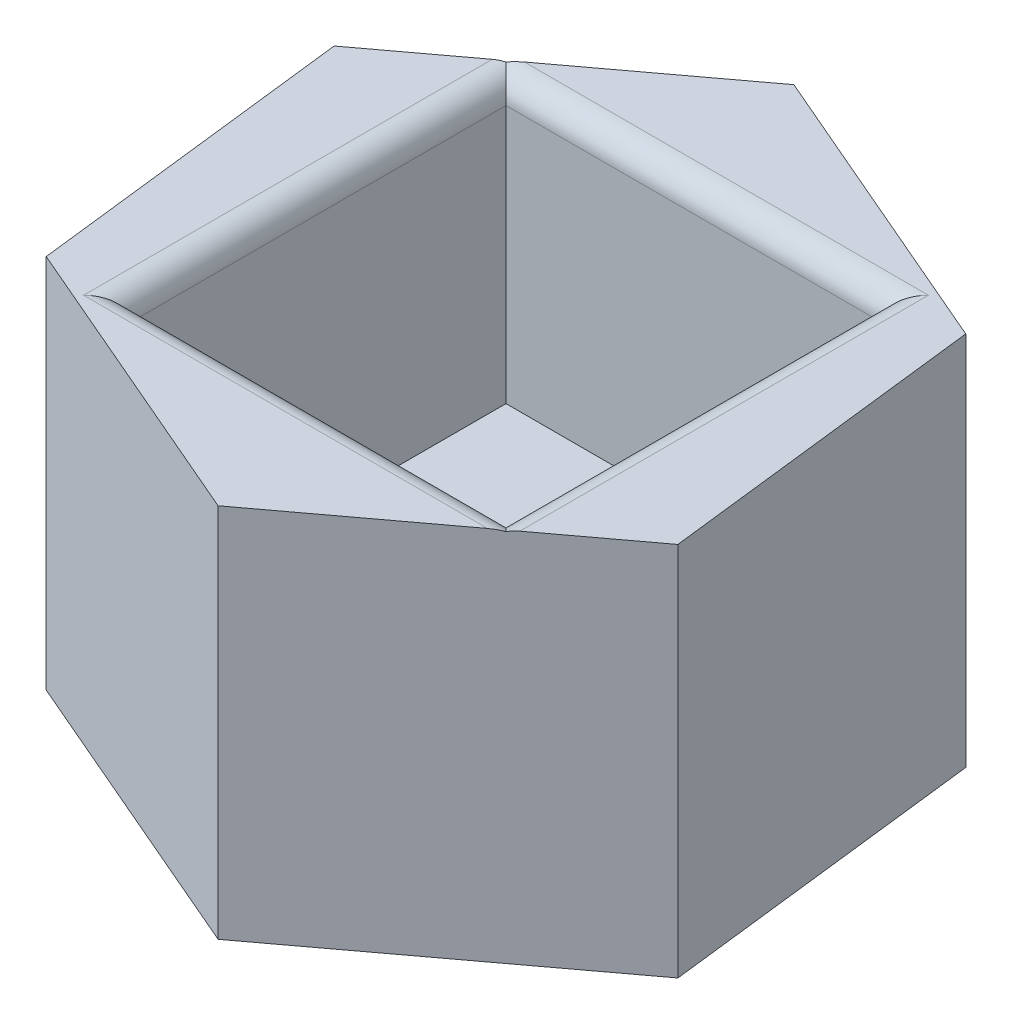
ISO-10303-21;
HEADER;
FILE_DESCRIPTION(('STEP AP214'),'2;1');
FILE_NAME('part.step','',(''),(''),'','','');
FILE_SCHEMA(('AUTOMOTIVE_DESIGN { 1 0 10303 214 1 1 1 1 }'));
ENDSEC;
DATA;
#1=APPLICATION_CONTEXT('core data for automotive mechanical design processes');
#2=APPLICATION_PROTOCOL_DEFINITION('international standard','automotive_design',2000,#1);
#3=PRODUCT_CONTEXT('',#1,'mechanical');
#4=PRODUCT('Part','Part','',(#3));
#5=PRODUCT_RELATED_PRODUCT_CATEGORY('part','',(#4));
#6=PRODUCT_DEFINITION_FORMATION('','',#4);
#7=PRODUCT_DEFINITION_CONTEXT('part definition',#1,'design');
#8=PRODUCT_DEFINITION('design','',#6,#7);
#9=PRODUCT_DEFINITION_SHAPE('','',#8);
#10=(LENGTH_UNIT() NAMED_UNIT(*) SI_UNIT(.MILLI.,.METRE.));
#11=(NAMED_UNIT(*) PLANE_ANGLE_UNIT() SI_UNIT($,.RADIAN.));
#12=(NAMED_UNIT(*) SI_UNIT($,.STERADIAN.) SOLID_ANGLE_UNIT());
#13=UNCERTAINTY_MEASURE_WITH_UNIT(LENGTH_MEASURE(1.E-05),#10,'distance_accuracy_value','');
#14=(GEOMETRIC_REPRESENTATION_CONTEXT(3) GLOBAL_UNCERTAINTY_ASSIGNED_CONTEXT((#13)) GLOBAL_UNIT_ASSIGNED_CONTEXT((#10,
#11,#12)) REPRESENTATION_CONTEXT('',''));
#15=CARTESIAN_POINT('',(0.,0.,0.));
#16=DIRECTION('',(0.,0.,1.));
#17=DIRECTION('',(1.,0.,0.));
#18=AXIS2_PLACEMENT_3D('',#15,#16,#17);
#19=CARTESIAN_POINT('',(0.,4.,0.));
#20=DIRECTION('',(0.,1.,0.));
#21=DIRECTION('',(0.,0.,1.));
#22=AXIS2_PLACEMENT_3D('',#19,#20,#21);
#23=PLANE('',#22);
#24=DIRECTION('',(1.,0.,0.));
#25=VECTOR('',#24,1.);
#26=CARTESIAN_POINT('',(0.,4.,-2.25));
#27=LINE('',#26,#25);
#28=CARTESIAN_POINT('',(-2.05318407785259,4.,-2.25));
#29=VERTEX_POINT('',#28);
#30=CARTESIAN_POINT('',(2.25,4.,-2.25));
#31=VERTEX_POINT('',#30);
#32=EDGE_CURVE('E289',#29,#31,#27,.T.);
#33=ORIENTED_EDGE('',*,*,#32,.T.);
#34=DIRECTION('',(0.,0.,-1.));
#35=VECTOR('',#34,1.);
#36=CARTESIAN_POINT('',(2.25,4.,2.));
#37=LINE('',#36,#35);
#38=CARTESIAN_POINT('',(2.25,4.,2.1032376772573));
#39=VERTEX_POINT('',#38);
#40=EDGE_CURVE('E292',#31,#39,#37,.F.);
#41=ORIENTED_EDGE('',*,*,#40,.T.);
#42=DIRECTION('',(0.801658028534698,0.,-0.597782908158021));
#43=VECTOR('',#42,1.);
#44=CARTESIAN_POINT('',(0.409031595509729,4.,3.47601685178233));
#45=LINE('',#44,#43);
#46=CARTESIAN_POINT('',(3.21483469538117,4.,1.38377667322926));
#47=VERTEX_POINT('',#46);
#48=EDGE_CURVE('E215',#39,#47,#45,.T.);
#49=ORIENTED_EDGE('',*,*,#48,.T.);
#50=DIRECTION('',(-0.116866170145637,0.,-0.99314767193781));
#51=VECTOR('',#50,1.);
#52=CARTESIAN_POINT('',(3.21483469538117,4.,1.38377667322926));
#53=LINE('',#52,#51);
#54=CARTESIAN_POINT('',(2.80580309987144,4.,-2.09224017855307));
#55=VERTEX_POINT('',#54);
#56=EDGE_CURVE('E214',#47,#55,#53,.T.);
#57=ORIENTED_EDGE('',*,*,#56,.T.);
#58=DIRECTION('',(-0.918524198680335,0.,-0.395364763779788));
#59=VECTOR('',#58,1.);
#60=CARTESIAN_POINT('',(2.80580309987144,4.,-2.09224017855307));
#61=LINE('',#60,#59);
#62=CARTESIAN_POINT('',(-0.409031595509729,4.,-3.47601685178233));
#63=VERTEX_POINT('',#62);
#64=EDGE_CURVE('E218',#55,#63,#61,.T.);
#65=ORIENTED_EDGE('',*,*,#64,.T.);
#66=DIRECTION('',(-0.801658028534698,0.,0.597782908158021));
#67=VECTOR('',#66,1.);
#68=CARTESIAN_POINT('',(-0.409031595509729,4.,-3.47601685178233));
#69=LINE('',#68,#67);
#70=EDGE_CURVE('E222',#63,#29,#69,.T.);
#71=ORIENTED_EDGE('',*,*,#70,.T.);
#72=EDGE_LOOP('',(#33,#41,#49,#57,#65,#71));
#73=FACE_BOUND('',#72,.T.);
#74=ADVANCED_FACE('F60',(#73),#23,.T.);
#75=CARTESIAN_POINT('',(0.409031595509729,4.,3.47601685178233));
#76=DIRECTION('',(-0.597782908158021,0.,-0.801658028534698));
#77=DIRECTION('',(-0.801658028534698,0.,0.597782908158021));
#78=AXIS2_PLACEMENT_3D('',#75,#76,#77);
#79=PLANE('',#78);
#80=CARTESIAN_POINT('',(2.25,3.75,2.1032376772573));
#81=DIRECTION('',(-0.597782908158021,0.,-0.801658028534698));
#82=DIRECTION('',(-0.801658028534698,0.,0.597782908158021));
#83=AXIS2_PLACEMENT_3D('',#80,#81,#82);
#84=ELLIPSE('',#83,0.311853672141174,0.25);
#85=CARTESIAN_POINT('',(2.1659284316842,3.98543995285619,2.1659284316842));
#86=VERTEX_POINT('',#85);
#87=EDGE_CURVE('E276',#39,#86,#84,.F.);
#88=ORIENTED_EDGE('',*,*,#87,.T.);
#89=CARTESIAN_POINT('',(2.05318407785259,3.75,2.25));
#90=DIRECTION('',(-0.597782908158021,0.,-0.801658028534698));
#91=DIRECTION('',(-0.801658028534698,0.,0.597782908158021));
#92=AXIS2_PLACEMENT_3D('',#89,#90,#91);
#93=ELLIPSE('',#92,0.418212024111458,0.25);
#94=CARTESIAN_POINT('',(2.05318407785259,4.,2.25));
#95=VERTEX_POINT('',#94);
#96=EDGE_CURVE('E279',#86,#95,#93,.F.);
#97=ORIENTED_EDGE('',*,*,#96,.T.);
#98=CARTESIAN_POINT('',(0.409031595509729,4.,3.47601685178233));
#99=VERTEX_POINT('',#98);
#100=EDGE_CURVE('E210',#99,#95,#45,.T.);
#101=ORIENTED_EDGE('',*,*,#100,.F.);
#102=DIRECTION('',(0.,-1.,0.));
#103=VECTOR('',#102,1.);
#104=CARTESIAN_POINT('',(0.409031595509729,4.,3.47601685178233));
#105=LINE('',#104,#103);
#106=CARTESIAN_POINT('',(0.409031595509729,0.,3.47601685178233));
#107=VERTEX_POINT('',#106);
#108=EDGE_CURVE('E232',#99,#107,#105,.T.);
#109=ORIENTED_EDGE('',*,*,#108,.T.);
#110=DIRECTION('',(0.801658028534698,0.,-0.597782908158021));
#111=VECTOR('',#110,1.);
#112=CARTESIAN_POINT('',(0.409031595509729,0.,3.47601685178233));
#113=LINE('',#112,#111);
#114=CARTESIAN_POINT('',(3.21483469538117,0.,1.38377667322926));
#115=VERTEX_POINT('',#114);
#116=EDGE_CURVE('E204',#107,#115,#113,.T.);
#117=ORIENTED_EDGE('',*,*,#116,.T.);
#118=DIRECTION('',(0.,-1.,0.));
#119=VECTOR('',#118,1.);
#120=CARTESIAN_POINT('',(3.21483469538117,4.,1.38377667322926));
#121=LINE('',#120,#119);
#122=EDGE_CURVE('E270',#47,#115,#121,.T.);
#123=ORIENTED_EDGE('',*,*,#122,.F.);
#124=ORIENTED_EDGE('',*,*,#48,.F.);
#125=EDGE_LOOP('',(#88,#97,#101,#109,#117,#123,#124));
#126=FACE_BOUND('',#125,.T.);
#127=ADVANCED_FACE('F338',(#126),#79,.F.);
#128=CARTESIAN_POINT('',(3.21483469538117,4.,1.38377667322926));
#129=DIRECTION('',(-0.99314767193781,0.,0.116866170145637));
#130=DIRECTION('',(0.116866170145637,0.,0.99314767193781));
#131=AXIS2_PLACEMENT_3D('',#128,#129,#130);
#132=PLANE('',#131);
#133=DIRECTION('',(-0.116866170145637,0.,-0.99314767193781));
#134=VECTOR('',#133,1.);
#135=CARTESIAN_POINT('',(3.21483469538117,0.,1.38377667322926));
#136=LINE('',#135,#134);
#137=CARTESIAN_POINT('',(2.80580309987144,0.,-2.09224017855307));
#138=VERTEX_POINT('',#137);
#139=EDGE_CURVE('E236',#115,#138,#136,.T.);
#140=ORIENTED_EDGE('',*,*,#139,.T.);
#141=DIRECTION('',(0.,-1.,0.));
#142=VECTOR('',#141,1.);
#143=CARTESIAN_POINT('',(2.80580309987144,4.,-2.09224017855307));
#144=LINE('',#143,#142);
#145=EDGE_CURVE('E266',#55,#138,#144,.T.);
#146=ORIENTED_EDGE('',*,*,#145,.F.);
#147=ORIENTED_EDGE('',*,*,#56,.F.);
#148=ORIENTED_EDGE('',*,*,#122,.T.);
#149=EDGE_LOOP('',(#140,#146,#147,#148));
#150=FACE_BOUND('',#149,.T.);
#151=ADVANCED_FACE('F346',(#150),#132,.F.);
#152=CARTESIAN_POINT('',(2.80580309987144,4.,-2.09224017855307));
#153=DIRECTION('',(-0.395364763779788,0.,0.918524198680335));
#154=DIRECTION('',(0.918524198680335,0.,0.395364763779788));
#155=AXIS2_PLACEMENT_3D('',#152,#153,#154);
#156=PLANE('',#155);
#157=DIRECTION('',(-0.918524198680335,0.,-0.395364763779788));
#158=VECTOR('',#157,1.);
#159=CARTESIAN_POINT('',(2.80580309987144,0.,-2.09224017855307));
#160=LINE('',#159,#158);
#161=CARTESIAN_POINT('',(-0.409031595509729,0.,-3.47601685178233));
#162=VERTEX_POINT('',#161);
#163=EDGE_CURVE('E239',#138,#162,#160,.T.);
#164=ORIENTED_EDGE('',*,*,#163,.T.);
#165=DIRECTION('',(0.,-1.,0.));
#166=VECTOR('',#165,1.);
#167=CARTESIAN_POINT('',(-0.409031595509729,4.,-3.47601685178233));
#168=LINE('',#167,#166);
#169=EDGE_CURVE('E262',#63,#162,#168,.T.);
#170=ORIENTED_EDGE('',*,*,#169,.F.);
#171=ORIENTED_EDGE('',*,*,#64,.F.);
#172=ORIENTED_EDGE('',*,*,#145,.T.);
#173=EDGE_LOOP('',(#164,#170,#171,#172));
#174=FACE_BOUND('',#173,.T.);
#175=ADVANCED_FACE('F389',(#174),#156,.F.);
#176=CARTESIAN_POINT('',(-0.409031595509729,4.,-3.47601685178233));
#177=DIRECTION('',(0.597782908158021,0.,0.801658028534698));
#178=DIRECTION('',(0.801658028534698,0.,-0.597782908158021));
#179=AXIS2_PLACEMENT_3D('',#176,#177,#178);
#180=PLANE('',#179);
#181=CARTESIAN_POINT('',(-2.25,3.75,-2.1032376772573));
#182=DIRECTION('',(0.597782908158021,0.,0.801658028534698));
#183=DIRECTION('',(0.801658028534698,0.,-0.597782908158021));
#184=AXIS2_PLACEMENT_3D('',#181,#182,#183);
#185=ELLIPSE('',#184,0.311853672141174,0.25);
#186=CARTESIAN_POINT('',(-2.25,4.,-2.1032376772573));
#187=VERTEX_POINT('',#186);
#188=CARTESIAN_POINT('',(-2.1659284316842,3.98543995285619,-2.1659284316842));
#189=VERTEX_POINT('',#188);
#190=EDGE_CURVE('E78',#187,#189,#185,.F.);
#191=ORIENTED_EDGE('',*,*,#190,.T.);
#192=CARTESIAN_POINT('',(-2.05318407785259,3.75,-2.25));
#193=DIRECTION('',(0.597782908158021,0.,0.801658028534698));
#194=DIRECTION('',(0.801658028534698,0.,-0.597782908158021));
#195=AXIS2_PLACEMENT_3D('',#192,#193,#194);
#196=ELLIPSE('',#195,0.418212024111458,0.25);
#197=EDGE_CURVE('E70',#189,#29,#196,.F.);
#198=ORIENTED_EDGE('',*,*,#197,.T.);
#199=ORIENTED_EDGE('',*,*,#70,.F.);
#200=ORIENTED_EDGE('',*,*,#169,.T.);
#201=DIRECTION('',(-0.801658028534698,0.,0.597782908158021));
#202=VECTOR('',#201,1.);
#203=CARTESIAN_POINT('',(-0.409031595509729,0.,-3.47601685178233));
#204=LINE('',#203,#202);
#205=CARTESIAN_POINT('',(-3.21483469538117,0.,-1.38377667322926));
#206=VERTEX_POINT('',#205);
#207=EDGE_CURVE('E242',#162,#206,#204,.T.);
#208=ORIENTED_EDGE('',*,*,#207,.T.);
#209=DIRECTION('',(0.,-1.,0.));
#210=VECTOR('',#209,1.);
#211=CARTESIAN_POINT('',(-3.21483469538117,4.,-1.38377667322926));
#212=LINE('',#211,#210);
#213=CARTESIAN_POINT('',(-3.21483469538117,4.,-1.38377667322926));
#214=VERTEX_POINT('',#213);
#215=EDGE_CURVE('E258',#214,#206,#212,.T.);
#216=ORIENTED_EDGE('',*,*,#215,.F.);
#217=EDGE_CURVE('E221',#187,#214,#69,.T.);
#218=ORIENTED_EDGE('',*,*,#217,.F.);
#219=EDGE_LOOP('',(#191,#198,#199,#200,#208,#216,#218));
#220=FACE_BOUND('',#219,.T.);
#221=ADVANCED_FACE('F373',(#220),#180,.F.);
#222=CARTESIAN_POINT('',(-3.21483469538117,4.,-1.38377667322926));
#223=DIRECTION('',(0.99314767193781,0.,-0.116866170145637));
#224=DIRECTION('',(-0.116866170145637,0.,-0.99314767193781));
#225=AXIS2_PLACEMENT_3D('',#222,#223,#224);
#226=PLANE('',#225);
#227=DIRECTION('',(0.116866170145637,0.,0.99314767193781));
#228=VECTOR('',#227,1.);
#229=CARTESIAN_POINT('',(-3.21483469538117,0.,-1.38377667322926));
#230=LINE('',#229,#228);
#231=CARTESIAN_POINT('',(-2.80580309987144,0.,2.09224017855307));
#232=VERTEX_POINT('',#231);
#233=EDGE_CURVE('E245',#206,#232,#230,.T.);
#234=ORIENTED_EDGE('',*,*,#233,.T.);
#235=DIRECTION('',(0.,-1.,0.));
#236=VECTOR('',#235,1.);
#237=CARTESIAN_POINT('',(-2.80580309987144,4.,2.09224017855307));
#238=LINE('',#237,#236);
#239=CARTESIAN_POINT('',(-2.80580309987144,4.,2.09224017855307));
#240=VERTEX_POINT('',#239);
#241=EDGE_CURVE('E254',#240,#232,#238,.T.);
#242=ORIENTED_EDGE('',*,*,#241,.F.);
#243=DIRECTION('',(0.116866170145637,0.,0.99314767193781));
#244=VECTOR('',#243,1.);
#245=CARTESIAN_POINT('',(-3.21483469538117,4.,-1.38377667322926));
#246=LINE('',#245,#244);
#247=EDGE_CURVE('E226',#214,#240,#246,.T.);
#248=ORIENTED_EDGE('',*,*,#247,.F.);
#249=ORIENTED_EDGE('',*,*,#215,.T.);
#250=EDGE_LOOP('',(#234,#242,#248,#249));
#251=FACE_BOUND('',#250,.T.);
#252=ADVANCED_FACE('F362',(#251),#226,.F.);
#253=CARTESIAN_POINT('',(-2.80580309987144,4.,2.09224017855307));
#254=DIRECTION('',(0.395364763779788,0.,-0.918524198680335));
#255=DIRECTION('',(-0.918524198680335,0.,-0.395364763779788));
#256=AXIS2_PLACEMENT_3D('',#253,#254,#255);
#257=PLANE('',#256);
#258=DIRECTION('',(0.918524198680335,0.,0.395364763779788));
#259=VECTOR('',#258,1.);
#260=CARTESIAN_POINT('',(-2.80580309987144,0.,2.09224017855307));
#261=LINE('',#260,#259);
#262=EDGE_CURVE('E248',#232,#107,#261,.T.);
#263=ORIENTED_EDGE('',*,*,#262,.T.);
#264=ORIENTED_EDGE('',*,*,#108,.F.);
#265=DIRECTION('',(0.918524198680335,0.,0.395364763779788));
#266=VECTOR('',#265,1.);
#267=CARTESIAN_POINT('',(-2.80580309987144,4.,2.09224017855307));
#268=LINE('',#267,#266);
#269=EDGE_CURVE('E229',#240,#99,#268,.T.);
#270=ORIENTED_EDGE('',*,*,#269,.F.);
#271=ORIENTED_EDGE('',*,*,#241,.T.);
#272=EDGE_LOOP('',(#263,#264,#270,#271));
#273=FACE_BOUND('',#272,.T.);
#274=ADVANCED_FACE('F353',(#273),#257,.F.);
#275=ORIENTED_EDGE('',*,*,#100,.T.);
#276=DIRECTION('',(1.,0.,0.));
#277=VECTOR('',#276,1.);
#278=CARTESIAN_POINT('',(-2.,4.,2.25));
#279=LINE('',#278,#277);
#280=CARTESIAN_POINT('',(-2.25,4.,2.25));
#281=VERTEX_POINT('',#280);
#282=EDGE_CURVE('E285',#95,#281,#279,.F.);
#283=ORIENTED_EDGE('',*,*,#282,.T.);
#284=DIRECTION('',(0.,0.,-1.));
#285=VECTOR('',#284,1.);
#286=CARTESIAN_POINT('',(-2.25,4.,0.));
#287=LINE('',#286,#285);
#288=EDGE_CURVE('E282',#281,#187,#287,.T.);
#289=ORIENTED_EDGE('',*,*,#288,.T.);
#290=ORIENTED_EDGE('',*,*,#217,.T.);
#291=ORIENTED_EDGE('',*,*,#247,.T.);
#292=ORIENTED_EDGE('',*,*,#269,.T.);
#293=EDGE_LOOP('',(#275,#283,#289,#290,#291,#292));
#294=FACE_BOUND('',#293,.T.);
#295=ADVANCED_FACE('F341',(#294),#23,.T.);
#296=CARTESIAN_POINT('',(0.,0.,0.));
#297=DIRECTION('',(0.,1.,0.));
#298=DIRECTION('',(0.,0.,1.));
#299=AXIS2_PLACEMENT_3D('',#296,#297,#298);
#300=PLANE('',#299);
#301=ORIENTED_EDGE('',*,*,#116,.F.);
#302=ORIENTED_EDGE('',*,*,#262,.F.);
#303=ORIENTED_EDGE('',*,*,#233,.F.);
#304=ORIENTED_EDGE('',*,*,#207,.F.);
#305=ORIENTED_EDGE('',*,*,#163,.F.);
#306=ORIENTED_EDGE('',*,*,#139,.F.);
#307=EDGE_LOOP('',(#301,#302,#303,#304,#305,#306));
#308=FACE_BOUND('',#307,.T.);
#309=ADVANCED_FACE('F352',(#308),#300,.F.);
#310=CARTESIAN_POINT('',(0.,1.,2.));
#311=DIRECTION('',(0.,0.,1.));
#312=DIRECTION('',(1.,0.,0.));
#313=AXIS2_PLACEMENT_3D('',#310,#311,#312);
#314=PLANE('',#313);
#315=DIRECTION('',(0.,1.,0.));
#316=VECTOR('',#315,1.);
#317=CARTESIAN_POINT('',(-2.,1.,2.));
#318=LINE('',#317,#316);
#319=CARTESIAN_POINT('',(-2.,1.,2.));
#320=VERTEX_POINT('',#319);
#321=CARTESIAN_POINT('',(-2.,3.75,2.));
#322=VERTEX_POINT('',#321);
#323=EDGE_CURVE('E201',#320,#322,#318,.T.);
#324=ORIENTED_EDGE('',*,*,#323,.T.);
#325=DIRECTION('',(1.,0.,0.));
#326=VECTOR('',#325,1.);
#327=CARTESIAN_POINT('',(2.,3.75,2.));
#328=LINE('',#327,#326);
#329=CARTESIAN_POINT('',(2.,3.75,2.));
#330=VERTEX_POINT('',#329);
#331=EDGE_CURVE('E174',#322,#330,#328,.T.);
#332=ORIENTED_EDGE('',*,*,#331,.T.);
#333=DIRECTION('',(0.,1.,0.));
#334=VECTOR('',#333,1.);
#335=CARTESIAN_POINT('',(2.,1.,2.));
#336=LINE('',#335,#334);
#337=CARTESIAN_POINT('',(2.,1.,2.));
#338=VERTEX_POINT('',#337);
#339=EDGE_CURVE('E167',#338,#330,#336,.T.);
#340=ORIENTED_EDGE('',*,*,#339,.F.);
#341=DIRECTION('',(1.,0.,0.));
#342=VECTOR('',#341,1.);
#343=CARTESIAN_POINT('',(0.,1.,2.));
#344=LINE('',#343,#342);
#345=EDGE_CURVE('E172',#320,#338,#344,.T.);
#346=ORIENTED_EDGE('',*,*,#345,.F.);
#347=EDGE_LOOP('',(#324,#332,#340,#346));
#348=FACE_BOUND('',#347,.T.);
#349=ADVANCED_FACE('F170',(#348),#314,.F.);
#350=CARTESIAN_POINT('',(-2.,1.,0.));
#351=DIRECTION('',(1.,0.,0.));
#352=DIRECTION('',(0.,0.,-1.));
#353=AXIS2_PLACEMENT_3D('',#350,#351,#352);
#354=PLANE('',#353);
#355=DIRECTION('',(0.,1.,0.));
#356=VECTOR('',#355,1.);
#357=CARTESIAN_POINT('',(-2.,1.,-2.));
#358=LINE('',#357,#356);
#359=CARTESIAN_POINT('',(-2.,1.,-2.));
#360=VERTEX_POINT('',#359);
#361=CARTESIAN_POINT('',(-2.,3.75,-2.));
#362=VERTEX_POINT('',#361);
#363=EDGE_CURVE('E205',#360,#362,#358,.T.);
#364=ORIENTED_EDGE('',*,*,#363,.T.);
#365=DIRECTION('',(0.,0.,-1.));
#366=VECTOR('',#365,1.);
#367=CARTESIAN_POINT('',(-2.,3.75,0.));
#368=LINE('',#367,#366);
#369=EDGE_CURVE('E12',#362,#322,#368,.F.);
#370=ORIENTED_EDGE('',*,*,#369,.T.);
#371=ORIENTED_EDGE('',*,*,#323,.F.);
#372=DIRECTION('',(0.,0.,-1.));
#373=VECTOR('',#372,1.);
#374=CARTESIAN_POINT('',(-2.,1.,0.));
#375=LINE('',#374,#373);
#376=EDGE_CURVE('E178',#320,#360,#375,.T.);
#377=ORIENTED_EDGE('',*,*,#376,.T.);
#378=EDGE_LOOP('',(#364,#370,#371,#377));
#379=FACE_BOUND('',#378,.T.);
#380=ADVANCED_FACE('F327',(#379),#354,.T.);
#381=CARTESIAN_POINT('',(0.,1.,-2.));
#382=DIRECTION('',(0.,0.,1.));
#383=DIRECTION('',(1.,0.,0.));
#384=AXIS2_PLACEMENT_3D('',#381,#382,#383);
#385=PLANE('',#384);
#386=DIRECTION('',(0.,1.,0.));
#387=VECTOR('',#386,1.);
#388=CARTESIAN_POINT('',(2.,1.,-2.));
#389=LINE('',#388,#387);
#390=CARTESIAN_POINT('',(2.,1.,-2.));
#391=VERTEX_POINT('',#390);
#392=CARTESIAN_POINT('',(2.,3.75,-2.));
#393=VERTEX_POINT('',#392);
#394=EDGE_CURVE('E177',#391,#393,#389,.T.);
#395=ORIENTED_EDGE('',*,*,#394,.T.);
#396=DIRECTION('',(1.,0.,0.));
#397=VECTOR('',#396,1.);
#398=CARTESIAN_POINT('',(0.,3.75,-2.));
#399=LINE('',#398,#397);
#400=EDGE_CURVE('E86',#393,#362,#399,.F.);
#401=ORIENTED_EDGE('',*,*,#400,.T.);
#402=ORIENTED_EDGE('',*,*,#363,.F.);
#403=DIRECTION('',(1.,0.,0.));
#404=VECTOR('',#403,1.);
#405=CARTESIAN_POINT('',(0.,1.,-2.));
#406=LINE('',#405,#404);
#407=EDGE_CURVE('E186',#360,#391,#406,.T.);
#408=ORIENTED_EDGE('',*,*,#407,.T.);
#409=EDGE_LOOP('',(#395,#401,#402,#408));
#410=FACE_BOUND('',#409,.T.);
#411=ADVANCED_FACE('F328',(#410),#385,.T.);
#412=CARTESIAN_POINT('',(2.,1.,0.));
#413=DIRECTION('',(1.,0.,0.));
#414=DIRECTION('',(0.,0.,-1.));
#415=AXIS2_PLACEMENT_3D('',#412,#413,#414);
#416=PLANE('',#415);
#417=ORIENTED_EDGE('',*,*,#339,.T.);
#418=DIRECTION('',(0.,0.,-1.));
#419=VECTOR('',#418,1.);
#420=CARTESIAN_POINT('',(2.,3.75,-2.));
#421=LINE('',#420,#419);
#422=EDGE_CURVE('E295',#330,#393,#421,.T.);
#423=ORIENTED_EDGE('',*,*,#422,.T.);
#424=ORIENTED_EDGE('',*,*,#394,.F.);
#425=DIRECTION('',(0.,0.,-1.));
#426=VECTOR('',#425,1.);
#427=CARTESIAN_POINT('',(2.,1.,0.));
#428=LINE('',#427,#426);
#429=EDGE_CURVE('E182',#338,#391,#428,.T.);
#430=ORIENTED_EDGE('',*,*,#429,.F.);
#431=EDGE_LOOP('',(#417,#423,#424,#430));
#432=FACE_BOUND('',#431,.T.);
#433=ADVANCED_FACE('F183',(#432),#416,.F.);
#434=CARTESIAN_POINT('',(0.,1.,0.));
#435=DIRECTION('',(0.,1.,0.));
#436=DIRECTION('',(0.,0.,1.));
#437=AXIS2_PLACEMENT_3D('',#434,#435,#436);
#438=PLANE('',#437);
#439=ORIENTED_EDGE('',*,*,#345,.T.);
#440=ORIENTED_EDGE('',*,*,#429,.T.);
#441=ORIENTED_EDGE('',*,*,#407,.F.);
#442=ORIENTED_EDGE('',*,*,#376,.F.);
#443=EDGE_LOOP('',(#439,#440,#441,#442));
#444=FACE_BOUND('',#443,.T.);
#445=ADVANCED_FACE('F189',(#444),#438,.T.);
#446=CARTESIAN_POINT('',(0.,3.75,-2.25));
#447=DIRECTION('',(1.,0.,0.));
#448=DIRECTION('',(0.,0.,-1.));
#449=AXIS2_PLACEMENT_3D('',#446,#447,#448);
#450=CYLINDRICAL_SURFACE('',#449,0.25);
#451=ORIENTED_EDGE('',*,*,#32,.F.);
#452=ORIENTED_EDGE('',*,*,#197,.F.);
#453=CARTESIAN_POINT('',(-2.25,3.75,-2.25));
#454=DIRECTION('',(0.707106781186547,0.,-0.707106781186547));
#455=DIRECTION('',(-0.707106781186547,0.,-0.707106781186547));
#456=AXIS2_PLACEMENT_3D('',#453,#454,#455);
#457=ELLIPSE('',#456,0.353553390593274,0.25);
#458=EDGE_CURVE('E64',#362,#189,#457,.F.);
#459=ORIENTED_EDGE('',*,*,#458,.F.);
#460=ORIENTED_EDGE('',*,*,#400,.F.);
#461=CARTESIAN_POINT('',(2.25,3.75,-2.25));
#462=DIRECTION('',(0.707106781186547,0.,0.707106781186547));
#463=DIRECTION('',(-0.707106781186547,0.,0.707106781186547));
#464=AXIS2_PLACEMENT_3D('',#461,#462,#463);
#465=ELLIPSE('',#464,0.353553390593274,0.25);
#466=EDGE_CURVE('E195',#31,#393,#465,.T.);
#467=ORIENTED_EDGE('',*,*,#466,.F.);
#468=EDGE_LOOP('',(#451,#452,#459,#460,#467));
#469=FACE_BOUND('',#468,.T.);
#470=ADVANCED_FACE('F62',(#469),#450,.T.);
#471=CARTESIAN_POINT('',(-2.25,3.75,0.));
#472=DIRECTION('',(0.,0.,-1.));
#473=DIRECTION('',(-1.,0.,0.));
#474=AXIS2_PLACEMENT_3D('',#471,#472,#473);
#475=CYLINDRICAL_SURFACE('',#474,0.25);
#476=ORIENTED_EDGE('',*,*,#190,.F.);
#477=ORIENTED_EDGE('',*,*,#288,.F.);
#478=CARTESIAN_POINT('',(-2.25,3.75,2.25));
#479=DIRECTION('',(-0.707106781186547,0.,-0.707106781186547));
#480=DIRECTION('',(-0.707106781186547,0.,0.707106781186547));
#481=AXIS2_PLACEMENT_3D('',#478,#479,#480);
#482=ELLIPSE('',#481,0.353553390593274,0.25);
#483=EDGE_CURVE('E307',#322,#281,#482,.F.);
#484=ORIENTED_EDGE('',*,*,#483,.F.);
#485=ORIENTED_EDGE('',*,*,#369,.F.);
#486=ORIENTED_EDGE('',*,*,#458,.T.);
#487=EDGE_LOOP('',(#476,#477,#484,#485,#486));
#488=FACE_BOUND('',#487,.T.);
#489=ADVANCED_FACE('F324',(#488),#475,.T.);
#490=CARTESIAN_POINT('',(2.25,3.75,0.));
#491=DIRECTION('',(0.,0.,1.));
#492=DIRECTION('',(1.,0.,0.));
#493=AXIS2_PLACEMENT_3D('',#490,#491,#492);
#494=CYLINDRICAL_SURFACE('',#493,0.25);
#495=ORIENTED_EDGE('',*,*,#466,.T.);
#496=ORIENTED_EDGE('',*,*,#422,.F.);
#497=CARTESIAN_POINT('',(2.25,3.75,2.25));
#498=DIRECTION('',(-0.707106781186547,0.,0.707106781186547));
#499=DIRECTION('',(0.707106781186547,0.,0.707106781186547));
#500=AXIS2_PLACEMENT_3D('',#497,#498,#499);
#501=ELLIPSE('',#500,0.353553390593274,0.25);
#502=EDGE_CURVE('E304',#86,#330,#501,.T.);
#503=ORIENTED_EDGE('',*,*,#502,.F.);
#504=ORIENTED_EDGE('',*,*,#87,.F.);
#505=ORIENTED_EDGE('',*,*,#40,.F.);
#506=EDGE_LOOP('',(#495,#496,#503,#504,#505));
#507=FACE_BOUND('',#506,.T.);
#508=ADVANCED_FACE('F315',(#507),#494,.T.);
#509=CARTESIAN_POINT('',(0.,3.75,2.25));
#510=DIRECTION('',(-1.,0.,0.));
#511=DIRECTION('',(0.,0.,1.));
#512=AXIS2_PLACEMENT_3D('',#509,#510,#511);
#513=CYLINDRICAL_SURFACE('',#512,0.25);
#514=ORIENTED_EDGE('',*,*,#483,.T.);
#515=ORIENTED_EDGE('',*,*,#282,.F.);
#516=ORIENTED_EDGE('',*,*,#96,.F.);
#517=ORIENTED_EDGE('',*,*,#502,.T.);
#518=ORIENTED_EDGE('',*,*,#331,.F.);
#519=EDGE_LOOP('',(#514,#515,#516,#517,#518));
#520=FACE_BOUND('',#519,.T.);
#521=ADVANCED_FACE('F371',(#520),#513,.T.);
#522=CLOSED_SHELL('',(#74,#127,#151,#175,#221,#252,#274,#295,#309,#349,#380,#411,#433,#445,#470,
#489,#508,#521));
#523=MANIFOLD_SOLID_BREP('B2',#522);
#524=ADVANCED_BREP_SHAPE_REPRESENTATION('',(#18,#523),#14);
#525=SHAPE_DEFINITION_REPRESENTATION(#9,#524);
ENDSEC;
END-ISO-10303-21;
